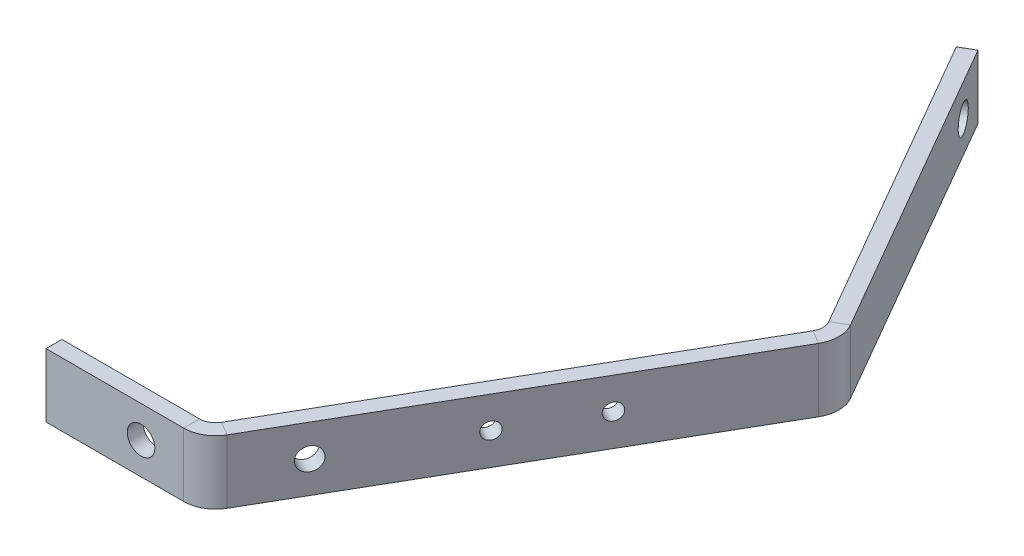
ISO-10303-21;
HEADER;
FILE_DESCRIPTION(('STEP AP214'),'2;1');
FILE_NAME('part.step','',(''),(''),'','','');
FILE_SCHEMA(('AUTOMOTIVE_DESIGN { 1 0 10303 214 1 1 1 1 }'));
ENDSEC;
DATA;
#1=APPLICATION_CONTEXT('core data for automotive mechanical design processes');
#2=APPLICATION_PROTOCOL_DEFINITION('international standard','automotive_design',2000,#1);
#3=PRODUCT_CONTEXT('',#1,'mechanical');
#4=PRODUCT('Part','Part','',(#3));
#5=PRODUCT_RELATED_PRODUCT_CATEGORY('part','',(#4));
#6=PRODUCT_DEFINITION_FORMATION('','',#4);
#7=PRODUCT_DEFINITION_CONTEXT('part definition',#1,'design');
#8=PRODUCT_DEFINITION('design','',#6,#7);
#9=PRODUCT_DEFINITION_SHAPE('','',#8);
#10=(LENGTH_UNIT() NAMED_UNIT(*) SI_UNIT(.MILLI.,.METRE.));
#11=(NAMED_UNIT(*) PLANE_ANGLE_UNIT() SI_UNIT($,.RADIAN.));
#12=(NAMED_UNIT(*) SI_UNIT($,.STERADIAN.) SOLID_ANGLE_UNIT());
#13=UNCERTAINTY_MEASURE_WITH_UNIT(LENGTH_MEASURE(1.E-05),#10,'distance_accuracy_value','');
#14=(GEOMETRIC_REPRESENTATION_CONTEXT(3) GLOBAL_UNCERTAINTY_ASSIGNED_CONTEXT((#13)) GLOBAL_UNIT_ASSIGNED_CONTEXT((#10,
#11,#12)) REPRESENTATION_CONTEXT('',''));
#15=CARTESIAN_POINT('',(0.,0.,0.));
#16=DIRECTION('',(0.,0.,1.));
#17=DIRECTION('',(1.,0.,0.));
#18=AXIS2_PLACEMENT_3D('',#15,#16,#17);
#19=CARTESIAN_POINT('',(-31.6157943029474,0.,-58.8228735853647));
#20=DIRECTION('',(-0.86602540378444,0.,-0.499999999999998));
#21=DIRECTION('',(-0.499999999999998,0.,0.86602540378444));
#22=AXIS2_PLACEMENT_3D('',#19,#20,#21);
#23=PLANE('',#22);
#24=CARTESIAN_POINT('',(-35.5167014642665,0.0399999999988743,-52.0663041863507));
#25=DIRECTION('',(-0.86602540378444,0.,-0.499999999999998));
#26=DIRECTION('',(-0.499999999999998,0.,0.86602540378444));
#27=AXIS2_PLACEMENT_3D('',#24,#25,#26);
#28=CIRCLE('',#27,1.65000000019319);
#29=CARTESIAN_POINT('',(-36.3417014643631,0.0399999999988743,-50.6373622699391));
#30=VERTEX_POINT('',#29);
#31=EDGE_CURVE('E615',#30,#30,#28,.T.);
#32=ORIENTED_EDGE('',*,*,#31,.T.);
#33=EDGE_LOOP('',(#32));
#34=FACE_BOUND('',#33,.T.);
#35=CARTESIAN_POINT('',(-57.7151263700535,0.,-13.617504401525));
#36=DIRECTION('',(-0.86602540378444,0.,-0.499999999999998));
#37=DIRECTION('',(-0.499999999999998,0.,0.86602540378444));
#38=AXIS2_PLACEMENT_3D('',#35,#36,#37);
#39=CIRCLE('',#38,2.25000000154887);
#40=CARTESIAN_POINT('',(-58.8401263708279,0.,-11.6689472416686));
#41=VERTEX_POINT('',#40);
#42=EDGE_CURVE('E616',#41,#41,#39,.T.);
#43=ORIENTED_EDGE('',*,*,#42,.T.);
#44=EDGE_LOOP('',(#43));
#45=FACE_BOUND('',#44,.T.);
#46=CARTESIAN_POINT('',(-44.4672014642664,0.0399999999988743,-36.5635834332055));
#47=DIRECTION('',(-0.86602540378444,0.,-0.499999999999998));
#48=DIRECTION('',(-0.499999999999998,0.,0.86602540378444));
#49=AXIS2_PLACEMENT_3D('',#46,#47,#48);
#50=CIRCLE('',#49,1.65);
#51=CARTESIAN_POINT('',(-45.2922014642664,0.0399999999988743,-35.1346415169612));
#52=VERTEX_POINT('',#51);
#53=EDGE_CURVE('E619',#52,#52,#50,.T.);
#54=ORIENTED_EDGE('',*,*,#53,.T.);
#55=EDGE_LOOP('',(#54));
#56=FACE_BOUND('',#55,.T.);
#57=DIRECTION('',(0.499999999999998,0.,-0.86602540378444));
#58=VECTOR('',#57,1.);
#59=CARTESIAN_POINT('',(-79.9907943029472,-6.35,24.9650842307798));
#60=LINE('',#59,#58);
#61=CARTESIAN_POINT('',(-63.7426657216148,-6.34999999999998,-3.17750000000001));
#62=VERTEX_POINT('',#61);
#63=CARTESIAN_POINT('',(-20.5207943029474,-6.35,-78.0399772953414));
#64=VERTEX_POINT('',#63);
#65=EDGE_CURVE('E62',#62,#64,#60,.T.);
#66=ORIENTED_EDGE('',*,*,#65,.T.);
#67=DIRECTION('',(0.,1.,0.));
#68=VECTOR('',#67,1.);
#69=CARTESIAN_POINT('',(-20.5207943029474,0.,-78.0399772953414));
#70=LINE('',#69,#68);
#71=CARTESIAN_POINT('',(-20.5207943029474,6.35,-78.0399772953414));
#72=VERTEX_POINT('',#71);
#73=EDGE_CURVE('E54',#64,#72,#70,.T.);
#74=ORIENTED_EDGE('',*,*,#73,.T.);
#75=DIRECTION('',(-0.499999999999998,0.,0.86602540378444));
#76=VECTOR('',#75,1.);
#77=CARTESIAN_POINT('',(-79.9907943029472,6.35,24.9650842307798));
#78=LINE('',#77,#76);
#79=CARTESIAN_POINT('',(-63.7426657216148,6.35,-3.17750000000001));
#80=VERTEX_POINT('',#79);
#81=EDGE_CURVE('E70',#72,#80,#78,.T.);
#82=ORIENTED_EDGE('',*,*,#81,.T.);
#83=DIRECTION('',(0.,1.,0.));
#84=VECTOR('',#83,1.);
#85=CARTESIAN_POINT('',(-63.7426657216148,0.,-3.17750000000001));
#86=LINE('',#85,#84);
#87=EDGE_CURVE('E232',#62,#80,#86,.T.);
#88=ORIENTED_EDGE('',*,*,#87,.F.);
#89=EDGE_LOOP('',(#66,#74,#82,#88));
#90=FACE_BOUND('',#89,.T.);
#91=ADVANCED_FACE('F45',(#34,#45,#56,#90),#23,.F.);
#92=CARTESIAN_POINT('',(-82.7404249599628,-6.35,23.3775842307799));
#93=DIRECTION('',(0.,-1.,0.));
#94=DIRECTION('',(-0.86602540378444,0.,-0.499999999999998));
#95=AXIS2_PLACEMENT_3D('',#92,#93,#94);
#96=PLANE('',#95);
#97=DIRECTION('',(-0.86602540378444,0.,-0.499999999999998));
#98=VECTOR('',#97,1.);
#99=CARTESIAN_POINT('',(-23.270424959963,-6.35,-79.6274772953414));
#100=LINE('',#99,#98);
#101=CARTESIAN_POINT('',(-23.270424959963,-6.34999999999999,-79.6274772953414));
#102=VERTEX_POINT('',#101);
#103=EDGE_CURVE('E12',#64,#102,#100,.T.);
#104=ORIENTED_EDGE('',*,*,#103,.F.);
#105=ORIENTED_EDGE('',*,*,#65,.F.);
#106=DIRECTION('',(-0.86602540378444,0.,-0.499999999999998));
#107=VECTOR('',#106,1.);
#108=CARTESIAN_POINT('',(-66.4922963786304,-6.35,-4.76500000000001));
#109=LINE('',#108,#107);
#110=CARTESIAN_POINT('',(-66.4922963786304,-6.34999999999999,-4.76500000000001));
#111=VERTEX_POINT('',#110);
#112=EDGE_CURVE('E228',#62,#111,#109,.T.);
#113=ORIENTED_EDGE('',*,*,#112,.T.);
#114=DIRECTION('',(0.499999999999998,0.,-0.86602540378444));
#115=VECTOR('',#114,1.);
#116=CARTESIAN_POINT('',(-82.7404249599628,-6.35,23.3775842307799));
#117=LINE('',#116,#115);
#118=EDGE_CURVE('E229',#111,#102,#117,.T.);
#119=ORIENTED_EDGE('',*,*,#118,.T.);
#120=EDGE_LOOP('',(#104,#105,#113,#119));
#121=FACE_BOUND('',#120,.T.);
#122=ADVANCED_FACE('F47',(#121),#96,.T.);
#123=CARTESIAN_POINT('',(-82.7404249599628,6.35,23.3775842307799));
#124=DIRECTION('',(0.,1.,0.));
#125=DIRECTION('',(0.86602540378444,0.,0.499999999999998));
#126=AXIS2_PLACEMENT_3D('',#123,#124,#125);
#127=PLANE('',#126);
#128=DIRECTION('',(0.86602540378444,0.,0.499999999999998));
#129=VECTOR('',#128,1.);
#130=CARTESIAN_POINT('',(-23.270424959963,6.35,-79.6274772953414));
#131=LINE('',#130,#129);
#132=CARTESIAN_POINT('',(-23.270424959963,6.35,-79.6274772953414));
#133=VERTEX_POINT('',#132);
#134=EDGE_CURVE('E240',#133,#72,#131,.T.);
#135=ORIENTED_EDGE('',*,*,#134,.F.);
#136=DIRECTION('',(-0.499999999999998,0.,0.86602540378444));
#137=VECTOR('',#136,1.);
#138=CARTESIAN_POINT('',(-82.7404249599628,6.35,23.3775842307799));
#139=LINE('',#138,#137);
#140=CARTESIAN_POINT('',(-66.4922963786304,6.35,-4.76500000000001));
#141=VERTEX_POINT('',#140);
#142=EDGE_CURVE('E245',#133,#141,#139,.T.);
#143=ORIENTED_EDGE('',*,*,#142,.T.);
#144=DIRECTION('',(0.86602540378444,0.,0.499999999999998));
#145=VECTOR('',#144,1.);
#146=CARTESIAN_POINT('',(-66.4922963786304,6.35,-4.76500000000001));
#147=LINE('',#146,#145);
#148=EDGE_CURVE('E235',#141,#80,#147,.T.);
#149=ORIENTED_EDGE('',*,*,#148,.T.);
#150=ORIENTED_EDGE('',*,*,#81,.F.);
#151=EDGE_LOOP('',(#135,#143,#149,#150));
#152=FACE_BOUND('',#151,.T.);
#153=ADVANCED_FACE('F292',(#152),#127,.T.);
#154=CARTESIAN_POINT('',(-34.365424959963,0.,-60.4103735853647));
#155=DIRECTION('',(-0.86602540378444,0.,-0.499999999999998));
#156=DIRECTION('',(-0.499999999999998,0.,0.86602540378444));
#157=AXIS2_PLACEMENT_3D('',#154,#155,#156);
#158=PLANE('',#157);
#159=CARTESIAN_POINT('',(-38.2663321212821,0.0399999999988743,-53.6538041863507));
#160=DIRECTION('',(-0.86602540378444,0.,-0.499999999999998));
#161=DIRECTION('',(-0.499999999999998,0.,0.86602540378444));
#162=AXIS2_PLACEMENT_3D('',#159,#160,#161);
#163=CIRCLE('',#162,1.65000000019319);
#164=CARTESIAN_POINT('',(-39.0913321213787,0.0399999999988743,-52.2248622699391));
#165=VERTEX_POINT('',#164);
#166=EDGE_CURVE('E613',#165,#165,#163,.T.);
#167=ORIENTED_EDGE('',*,*,#166,.F.);
#168=EDGE_LOOP('',(#167));
#169=FACE_BOUND('',#168,.T.);
#170=CARTESIAN_POINT('',(-60.4647570270691,0.,-15.205004401525));
#171=DIRECTION('',(-0.86602540378444,0.,-0.499999999999998));
#172=DIRECTION('',(-0.499999999999998,0.,0.86602540378444));
#173=AXIS2_PLACEMENT_3D('',#170,#171,#172);
#174=CIRCLE('',#173,2.25000000154887);
#175=CARTESIAN_POINT('',(-61.5897570278436,0.,-13.2564472416686));
#176=VERTEX_POINT('',#175);
#177=EDGE_CURVE('E627',#176,#176,#174,.T.);
#178=ORIENTED_EDGE('',*,*,#177,.F.);
#179=EDGE_LOOP('',(#178));
#180=FACE_BOUND('',#179,.T.);
#181=CARTESIAN_POINT('',(-47.216832121282,0.0399999999988743,-38.1510834332055));
#182=DIRECTION('',(-0.86602540378444,0.,-0.499999999999998));
#183=DIRECTION('',(-0.499999999999998,0.,0.86602540378444));
#184=AXIS2_PLACEMENT_3D('',#181,#182,#183);
#185=CIRCLE('',#184,1.65);
#186=CARTESIAN_POINT('',(-48.041832121282,0.0399999999988743,-36.7221415169612));
#187=VERTEX_POINT('',#186);
#188=EDGE_CURVE('E624',#187,#187,#185,.T.);
#189=ORIENTED_EDGE('',*,*,#188,.F.);
#190=EDGE_LOOP('',(#189));
#191=FACE_BOUND('',#190,.T.);
#192=DIRECTION('',(0.,1.,0.));
#193=VECTOR('',#192,1.);
#194=CARTESIAN_POINT('',(-23.270424959963,0.,-79.6274772953414));
#195=LINE('',#194,#193);
#196=EDGE_CURVE('E237',#102,#133,#195,.T.);
#197=ORIENTED_EDGE('',*,*,#196,.F.);
#198=ORIENTED_EDGE('',*,*,#118,.F.);
#199=DIRECTION('',(0.,1.,0.));
#200=VECTOR('',#199,1.);
#201=CARTESIAN_POINT('',(-66.4922963786304,0.,-4.76500000000001));
#202=LINE('',#201,#200);
#203=EDGE_CURVE('E225',#111,#141,#202,.T.);
#204=ORIENTED_EDGE('',*,*,#203,.T.);
#205=ORIENTED_EDGE('',*,*,#142,.F.);
#206=EDGE_LOOP('',(#197,#198,#204,#205));
#207=FACE_BOUND('',#206,.T.);
#208=ADVANCED_FACE('F284',(#169,#180,#191,#207),#158,.T.);
#209=CARTESIAN_POINT('',(-96.75,-6.35,-3.175));
#210=DIRECTION('',(-1.,0.,0.));
#211=DIRECTION('',(0.,0.,1.));
#212=AXIS2_PLACEMENT_3D('',#209,#210,#211);
#213=PLANE('',#212);
#214=DIRECTION('',(0.,-1.,0.));
#215=VECTOR('',#214,1.);
#216=CARTESIAN_POINT('',(-96.75,-6.35,0.));
#217=LINE('',#216,#215);
#218=CARTESIAN_POINT('',(-96.75,6.35,0.));
#219=VERTEX_POINT('',#218);
#220=CARTESIAN_POINT('',(-96.75,-6.35,0.));
#221=VERTEX_POINT('',#220);
#222=EDGE_CURVE('E200',#219,#221,#217,.T.);
#223=ORIENTED_EDGE('',*,*,#222,.F.);
#224=DIRECTION('',(0.,0.,1.));
#225=VECTOR('',#224,1.);
#226=CARTESIAN_POINT('',(-96.75,6.35,-3.175));
#227=LINE('',#226,#225);
#228=CARTESIAN_POINT('',(-96.75,6.35,-3.175));
#229=VERTEX_POINT('',#228);
#230=EDGE_CURVE('E195',#229,#219,#227,.T.);
#231=ORIENTED_EDGE('',*,*,#230,.F.);
#232=DIRECTION('',(0.,-1.,0.));
#233=VECTOR('',#232,1.);
#234=CARTESIAN_POINT('',(-96.75,-6.35,-3.175));
#235=LINE('',#234,#233);
#236=CARTESIAN_POINT('',(-96.75,-6.35,-3.175));
#237=VERTEX_POINT('',#236);
#238=EDGE_CURVE('E214',#229,#237,#235,.T.);
#239=ORIENTED_EDGE('',*,*,#238,.T.);
#240=DIRECTION('',(0.,0.,1.));
#241=VECTOR('',#240,1.);
#242=CARTESIAN_POINT('',(-96.75,-6.35,-3.175));
#243=LINE('',#242,#241);
#244=EDGE_CURVE('E212',#237,#221,#243,.T.);
#245=ORIENTED_EDGE('',*,*,#244,.T.);
#246=EDGE_LOOP('',(#223,#231,#239,#245));
#247=FACE_BOUND('',#246,.T.);
#248=ADVANCED_FACE('F324',(#247),#213,.T.);
#249=CARTESIAN_POINT('',(0.,0.,-3.175));
#250=DIRECTION('',(0.,0.,-1.));
#251=DIRECTION('',(-1.,0.,0.));
#252=AXIS2_PLACEMENT_3D('',#249,#250,#251);
#253=PLANE('',#252);
#254=CARTESIAN_POINT('',(-77.7722006397986,3.02535774210355E-12,-3.175));
#255=DIRECTION('',(0.,0.,-1.));
#256=DIRECTION('',(-1.,0.,0.));
#257=AXIS2_PLACEMENT_3D('',#254,#255,#256);
#258=CIRCLE('',#257,2.74999999950133);
#259=CARTESIAN_POINT('',(-80.5222006392999,3.02535774210355E-12,-3.175));
#260=VERTEX_POINT('',#259);
#261=EDGE_CURVE('E257',#260,#260,#258,.T.);
#262=ORIENTED_EDGE('',*,*,#261,.F.);
#263=EDGE_LOOP('',(#262));
#264=FACE_BOUND('',#263,.T.);
#265=DIRECTION('',(0.,1.,0.));
#266=VECTOR('',#265,1.);
#267=CARTESIAN_POINT('',(-69.2462571626649,0.,-3.175));
#268=LINE('',#267,#266);
#269=CARTESIAN_POINT('',(-69.2462571626649,-6.34999999999999,-3.175));
#270=VERTEX_POINT('',#269);
#271=CARTESIAN_POINT('',(-69.2462571626649,6.35,-3.175));
#272=VERTEX_POINT('',#271);
#273=EDGE_CURVE('E190',#270,#272,#268,.T.);
#274=ORIENTED_EDGE('',*,*,#273,.F.);
#275=DIRECTION('',(1.,0.,0.));
#276=VECTOR('',#275,1.);
#277=CARTESIAN_POINT('',(-96.75,-6.35,-3.175));
#278=LINE('',#277,#276);
#279=EDGE_CURVE('E210',#237,#270,#278,.T.);
#280=ORIENTED_EDGE('',*,*,#279,.F.);
#281=ORIENTED_EDGE('',*,*,#238,.F.);
#282=DIRECTION('',(-1.,0.,0.));
#283=VECTOR('',#282,1.);
#284=CARTESIAN_POINT('',(-96.75,6.35,-3.175));
#285=LINE('',#284,#283);
#286=EDGE_CURVE('E198',#272,#229,#285,.T.);
#287=ORIENTED_EDGE('',*,*,#286,.F.);
#288=EDGE_LOOP('',(#274,#280,#281,#287));
#289=FACE_BOUND('',#288,.T.);
#290=ADVANCED_FACE('F316',(#264,#289),#253,.T.);
#291=CARTESIAN_POINT('',(-96.75,-6.35,-3.175));
#292=DIRECTION('',(0.,-1.,0.));
#293=DIRECTION('',(0.,0.,-1.));
#294=AXIS2_PLACEMENT_3D('',#291,#292,#293);
#295=PLANE('',#294);
#296=DIRECTION('',(0.,0.,-1.));
#297=VECTOR('',#296,1.);
#298=CARTESIAN_POINT('',(-69.2462571626649,-6.35,-3.175));
#299=LINE('',#298,#297);
#300=CARTESIAN_POINT('',(-69.2462571626649,-6.35,0.));
#301=VERTEX_POINT('',#300);
#302=EDGE_CURVE('E217',#301,#270,#299,.T.);
#303=ORIENTED_EDGE('',*,*,#302,.F.);
#304=DIRECTION('',(1.,0.,0.));
#305=VECTOR('',#304,1.);
#306=CARTESIAN_POINT('',(-96.75,-6.35,0.));
#307=LINE('',#306,#305);
#308=EDGE_CURVE('E208',#221,#301,#307,.T.);
#309=ORIENTED_EDGE('',*,*,#308,.F.);
#310=ORIENTED_EDGE('',*,*,#244,.F.);
#311=ORIENTED_EDGE('',*,*,#279,.T.);
#312=EDGE_LOOP('',(#303,#309,#310,#311));
#313=FACE_BOUND('',#312,.T.);
#314=ADVANCED_FACE('F312',(#313),#295,.T.);
#315=CARTESIAN_POINT('',(0.,0.,0.));
#316=DIRECTION('',(0.,0.,-1.));
#317=DIRECTION('',(-1.,0.,0.));
#318=AXIS2_PLACEMENT_3D('',#315,#316,#317);
#319=PLANE('',#318);
#320=CARTESIAN_POINT('',(-77.7722006397986,3.02535774210355E-12,0.));
#321=DIRECTION('',(0.,0.,-1.));
#322=DIRECTION('',(-1.,0.,0.));
#323=AXIS2_PLACEMENT_3D('',#320,#321,#322);
#324=CIRCLE('',#323,2.74999999950133);
#325=CARTESIAN_POINT('',(-80.5222006392999,3.02535774210355E-12,0.));
#326=VERTEX_POINT('',#325);
#327=EDGE_CURVE('E49',#326,#326,#324,.T.);
#328=ORIENTED_EDGE('',*,*,#327,.T.);
#329=EDGE_LOOP('',(#328));
#330=FACE_BOUND('',#329,.T.);
#331=ORIENTED_EDGE('',*,*,#308,.T.);
#332=DIRECTION('',(0.,1.,0.));
#333=VECTOR('',#332,1.);
#334=CARTESIAN_POINT('',(-69.2462571626649,0.,0.));
#335=LINE('',#334,#333);
#336=CARTESIAN_POINT('',(-69.2462571626649,6.35,0.));
#337=VERTEX_POINT('',#336);
#338=EDGE_CURVE('E205',#301,#337,#335,.T.);
#339=ORIENTED_EDGE('',*,*,#338,.T.);
#340=DIRECTION('',(-1.,0.,0.));
#341=VECTOR('',#340,1.);
#342=CARTESIAN_POINT('',(-96.75,6.35,0.));
#343=LINE('',#342,#341);
#344=EDGE_CURVE('E203',#337,#219,#343,.T.);
#345=ORIENTED_EDGE('',*,*,#344,.T.);
#346=ORIENTED_EDGE('',*,*,#222,.T.);
#347=EDGE_LOOP('',(#331,#339,#345,#346));
#348=FACE_BOUND('',#347,.T.);
#349=ADVANCED_FACE('F322',(#330,#348),#319,.F.);
#350=CARTESIAN_POINT('',(-96.75,6.35,-3.175));
#351=DIRECTION('',(0.,1.,0.));
#352=DIRECTION('',(0.,0.,1.));
#353=AXIS2_PLACEMENT_3D('',#350,#351,#352);
#354=PLANE('',#353);
#355=DIRECTION('',(0.,0.,1.));
#356=VECTOR('',#355,1.);
#357=CARTESIAN_POINT('',(-69.2462571626649,6.35,-3.175));
#358=LINE('',#357,#356);
#359=EDGE_CURVE('E220',#272,#337,#358,.T.);
#360=ORIENTED_EDGE('',*,*,#359,.F.);
#361=ORIENTED_EDGE('',*,*,#286,.T.);
#362=ORIENTED_EDGE('',*,*,#230,.T.);
#363=ORIENTED_EDGE('',*,*,#344,.F.);
#364=EDGE_LOOP('',(#360,#361,#362,#363));
#365=FACE_BOUND('',#364,.T.);
#366=ADVANCED_FACE('F319',(#365),#354,.T.);
#367=CARTESIAN_POINT('',(-69.2462571626649,-6.34999999999999,-6.355));
#368=DIRECTION('',(0.,1.,0.));
#369=DIRECTION('',(0.,0.,1.));
#370=AXIS2_PLACEMENT_3D('',#367,#368,#369);
#371=PLANE('',#370);
#372=ORIENTED_EDGE('',*,*,#112,.F.);
#373=CARTESIAN_POINT('',(-69.2462571626649,-6.34999999999998,-6.355));
#374=DIRECTION('',(0.,-1.,0.));
#375=DIRECTION('',(0.,0.,-1.));
#376=AXIS2_PLACEMENT_3D('',#373,#374,#375);
#377=CIRCLE('',#376,6.355);
#378=EDGE_CURVE('E178',#62,#301,#377,.T.);
#379=ORIENTED_EDGE('',*,*,#378,.T.);
#380=ORIENTED_EDGE('',*,*,#302,.T.);
#381=CARTESIAN_POINT('',(-69.2462571626649,-6.34999999999999,-6.355));
#382=DIRECTION('',(0.,-1.,0.));
#383=DIRECTION('',(0.,0.,1.));
#384=AXIS2_PLACEMENT_3D('',#381,#382,#383);
#385=CIRCLE('',#384,3.18);
#386=EDGE_CURVE('E183',#111,#270,#385,.T.);
#387=ORIENTED_EDGE('',*,*,#386,.F.);
#388=EDGE_LOOP('',(#372,#379,#380,#387));
#389=FACE_BOUND('',#388,.T.);
#390=ADVANCED_FACE('F308',(#389),#371,.F.);
#391=CARTESIAN_POINT('',(-69.2462571626649,6.35,-6.355));
#392=DIRECTION('',(0.,-1.,0.));
#393=DIRECTION('',(0.,0.,-1.));
#394=AXIS2_PLACEMENT_3D('',#391,#392,#393);
#395=PLANE('',#394);
#396=CARTESIAN_POINT('',(-69.2462571626649,6.35,-6.355));
#397=DIRECTION('',(0.,-1.,0.));
#398=DIRECTION('',(0.,0.,-1.));
#399=AXIS2_PLACEMENT_3D('',#396,#397,#398);
#400=CIRCLE('',#399,6.355);
#401=EDGE_CURVE('E187',#337,#80,#400,.F.);
#402=ORIENTED_EDGE('',*,*,#401,.T.);
#403=ORIENTED_EDGE('',*,*,#148,.F.);
#404=CARTESIAN_POINT('',(-69.2462571626649,6.35,-6.355));
#405=DIRECTION('',(0.,1.,0.));
#406=DIRECTION('',(0.,0.,-1.));
#407=AXIS2_PLACEMENT_3D('',#404,#405,#406);
#408=CIRCLE('',#407,3.18);
#409=EDGE_CURVE('E186',#272,#141,#408,.T.);
#410=ORIENTED_EDGE('',*,*,#409,.F.);
#411=ORIENTED_EDGE('',*,*,#359,.T.);
#412=EDGE_LOOP('',(#402,#403,#410,#411));
#413=FACE_BOUND('',#412,.T.);
#414=ADVANCED_FACE('F300',(#413),#395,.F.);
#415=CARTESIAN_POINT('',(-69.2462571626649,14.0105611696542,-6.355));
#416=DIRECTION('',(0.,-1.,0.));
#417=DIRECTION('',(0.,0.,-1.));
#418=AXIS2_PLACEMENT_3D('',#415,#416,#417);
#419=CYLINDRICAL_SURFACE('',#418,3.18);
#420=ORIENTED_EDGE('',*,*,#273,.T.);
#421=ORIENTED_EDGE('',*,*,#409,.T.);
#422=ORIENTED_EDGE('',*,*,#203,.F.);
#423=ORIENTED_EDGE('',*,*,#386,.T.);
#424=EDGE_LOOP('',(#420,#421,#422,#423));
#425=FACE_BOUND('',#424,.T.);
#426=ADVANCED_FACE('F296',(#425),#419,.F.);
#427=CARTESIAN_POINT('',(-69.2462571626649,14.0105611696542,-6.355));
#428=DIRECTION('',(0.,-1.,0.));
#429=DIRECTION('',(0.,0.,-1.));
#430=AXIS2_PLACEMENT_3D('',#427,#428,#429);
#431=CYLINDRICAL_SURFACE('',#430,6.355);
#432=ORIENTED_EDGE('',*,*,#338,.F.);
#433=ORIENTED_EDGE('',*,*,#378,.F.);
#434=ORIENTED_EDGE('',*,*,#87,.T.);
#435=ORIENTED_EDGE('',*,*,#401,.F.);
#436=EDGE_LOOP('',(#432,#433,#434,#435));
#437=FACE_BOUND('',#436,.T.);
#438=ADVANCED_FACE('F305',(#437),#431,.T.);
#439=CARTESIAN_POINT('',(-26.0243857439975,-6.34999999999999,-81.2174772953414));
#440=DIRECTION('',(0.,1.,0.));
#441=DIRECTION('',(0.,0.,1.));
#442=AXIS2_PLACEMENT_3D('',#439,#440,#441);
#443=PLANE('',#442);
#444=DIRECTION('',(-0.866025403784436,0.,0.500000000000004));
#445=VECTOR('',#444,1.);
#446=CARTESIAN_POINT('',(-23.270424959963,-6.35,-82.8074772953414));
#447=LINE('',#446,#445);
#448=CARTESIAN_POINT('',(-20.5207943029475,-6.35,-84.3949772953415));
#449=VERTEX_POINT('',#448);
#450=CARTESIAN_POINT('',(-23.270424959963,-6.34999999999999,-82.8074772953414));
#451=VERTEX_POINT('',#450);
#452=EDGE_CURVE('E144',#449,#451,#447,.T.);
#453=ORIENTED_EDGE('',*,*,#452,.F.);
#454=CARTESIAN_POINT('',(-26.0243857439975,-6.34999999999998,-81.2174772953414));
#455=DIRECTION('',(0.,-1.,0.));
#456=DIRECTION('',(0.,0.,-1.));
#457=AXIS2_PLACEMENT_3D('',#454,#455,#456);
#458=CIRCLE('',#457,6.355);
#459=EDGE_CURVE('E155',#449,#64,#458,.T.);
#460=ORIENTED_EDGE('',*,*,#459,.T.);
#461=ORIENTED_EDGE('',*,*,#103,.T.);
#462=CARTESIAN_POINT('',(-26.0243857439975,-6.34999999999999,-81.2174772953414));
#463=DIRECTION('',(0.,-1.,0.));
#464=DIRECTION('',(0.,0.,1.));
#465=AXIS2_PLACEMENT_3D('',#462,#463,#464);
#466=CIRCLE('',#465,3.18);
#467=EDGE_CURVE('E171',#451,#102,#466,.T.);
#468=ORIENTED_EDGE('',*,*,#467,.F.);
#469=EDGE_LOOP('',(#453,#460,#461,#468));
#470=FACE_BOUND('',#469,.T.);
#471=ADVANCED_FACE('F286',(#470),#443,.F.);
#472=CARTESIAN_POINT('',(-26.0243857439975,6.35,-81.2174772953414));
#473=DIRECTION('',(0.,-1.,0.));
#474=DIRECTION('',(0.,0.,-1.));
#475=AXIS2_PLACEMENT_3D('',#472,#473,#474);
#476=PLANE('',#475);
#477=CARTESIAN_POINT('',(-26.0243857439975,6.35,-81.2174772953414));
#478=DIRECTION('',(0.,-1.,0.));
#479=DIRECTION('',(0.,0.,-1.));
#480=AXIS2_PLACEMENT_3D('',#477,#478,#479);
#481=CIRCLE('',#480,6.355);
#482=CARTESIAN_POINT('',(-20.5207943029475,6.35,-84.3949772953415));
#483=VERTEX_POINT('',#482);
#484=EDGE_CURVE('E175',#72,#483,#481,.F.);
#485=ORIENTED_EDGE('',*,*,#484,.T.);
#486=DIRECTION('',(0.866025403784436,0.,-0.500000000000004));
#487=VECTOR('',#486,1.);
#488=CARTESIAN_POINT('',(-23.270424959963,6.35,-82.8074772953414));
#489=LINE('',#488,#487);
#490=CARTESIAN_POINT('',(-23.2704249599631,6.35,-82.8074772953414));
#491=VERTEX_POINT('',#490);
#492=EDGE_CURVE('E267',#491,#483,#489,.T.);
#493=ORIENTED_EDGE('',*,*,#492,.F.);
#494=CARTESIAN_POINT('',(-26.0243857439975,6.35,-81.2174772953414));
#495=DIRECTION('',(0.,1.,0.));
#496=DIRECTION('',(0.,0.,-1.));
#497=AXIS2_PLACEMENT_3D('',#494,#495,#496);
#498=CIRCLE('',#497,3.18);
#499=EDGE_CURVE('E174',#133,#491,#498,.T.);
#500=ORIENTED_EDGE('',*,*,#499,.F.);
#501=ORIENTED_EDGE('',*,*,#134,.T.);
#502=EDGE_LOOP('',(#485,#493,#500,#501));
#503=FACE_BOUND('',#502,.T.);
#504=ADVANCED_FACE('F278',(#503),#476,.F.);
#505=CARTESIAN_POINT('',(-26.0243857439975,14.9583075639477,-81.2174772953414));
#506=DIRECTION('',(0.,-1.,0.));
#507=DIRECTION('',(0.,0.,-1.));
#508=AXIS2_PLACEMENT_3D('',#505,#506,#507);
#509=CYLINDRICAL_SURFACE('',#508,3.18);
#510=ORIENTED_EDGE('',*,*,#196,.T.);
#511=ORIENTED_EDGE('',*,*,#499,.T.);
#512=DIRECTION('',(0.,1.,0.));
#513=VECTOR('',#512,1.);
#514=CARTESIAN_POINT('',(-23.2704249599631,0.,-82.8074772953414));
#515=LINE('',#514,#513);
#516=EDGE_CURVE('E164',#451,#491,#515,.T.);
#517=ORIENTED_EDGE('',*,*,#516,.F.);
#518=ORIENTED_EDGE('',*,*,#467,.T.);
#519=EDGE_LOOP('',(#510,#511,#517,#518));
#520=FACE_BOUND('',#519,.T.);
#521=ADVANCED_FACE('F280',(#520),#509,.F.);
#522=CARTESIAN_POINT('',(-26.0243857439975,14.9583075639477,-81.2174772953414));
#523=DIRECTION('',(0.,-1.,0.));
#524=DIRECTION('',(0.,0.,-1.));
#525=AXIS2_PLACEMENT_3D('',#522,#523,#524);
#526=CYLINDRICAL_SURFACE('',#525,6.355);
#527=ORIENTED_EDGE('',*,*,#73,.F.);
#528=ORIENTED_EDGE('',*,*,#459,.F.);
#529=DIRECTION('',(0.,1.,0.));
#530=VECTOR('',#529,1.);
#531=CARTESIAN_POINT('',(-20.5207943029475,0.,-84.3949772953414));
#532=LINE('',#531,#530);
#533=EDGE_CURVE('E162',#449,#483,#532,.T.);
#534=ORIENTED_EDGE('',*,*,#533,.T.);
#535=ORIENTED_EDGE('',*,*,#484,.F.);
#536=EDGE_LOOP('',(#527,#528,#534,#535));
#537=FACE_BOUND('',#536,.T.);
#538=ADVANCED_FACE('F291',(#537),#526,.T.);
#539=CARTESIAN_POINT('',(-58.0541677972985,-6.35,-143.054687167016));
#540=DIRECTION('',(-0.500000000000004,0.,-0.866025403784436));
#541=DIRECTION('',(-0.866025403784436,0.,0.500000000000004));
#542=AXIS2_PLACEMENT_3D('',#539,#540,#541);
#543=PLANE('',#542);
#544=DIRECTION('',(0.,1.,0.));
#545=VECTOR('',#544,1.);
#546=CARTESIAN_POINT('',(-55.3045371402829,-6.35,-144.642187167016));
#547=LINE('',#546,#545);
#548=CARTESIAN_POINT('',(-55.3045371402829,-6.35,-144.642187167016));
#549=VERTEX_POINT('',#548);
#550=CARTESIAN_POINT('',(-55.3045371402829,6.35,-144.642187167016));
#551=VERTEX_POINT('',#550);
#552=EDGE_CURVE('E154',#549,#551,#547,.T.);
#553=ORIENTED_EDGE('',*,*,#552,.F.);
#554=DIRECTION('',(0.866025403784436,0.,-0.500000000000004));
#555=VECTOR('',#554,1.);
#556=CARTESIAN_POINT('',(-58.0541677972985,-6.35,-143.054687167016));
#557=LINE('',#556,#555);
#558=CARTESIAN_POINT('',(-58.0541677972985,-6.35,-143.054687167016));
#559=VERTEX_POINT('',#558);
#560=EDGE_CURVE('E141',#559,#549,#557,.T.);
#561=ORIENTED_EDGE('',*,*,#560,.F.);
#562=DIRECTION('',(0.,1.,0.));
#563=VECTOR('',#562,1.);
#564=CARTESIAN_POINT('',(-58.0541677972985,-6.35,-143.054687167016));
#565=LINE('',#564,#563);
#566=CARTESIAN_POINT('',(-58.0541677972985,6.35,-143.054687167016));
#567=VERTEX_POINT('',#566);
#568=EDGE_CURVE('E152',#559,#567,#565,.T.);
#569=ORIENTED_EDGE('',*,*,#568,.T.);
#570=DIRECTION('',(0.866025403784436,0.,-0.500000000000004));
#571=VECTOR('',#570,1.);
#572=CARTESIAN_POINT('',(-58.0541677972985,6.35,-143.054687167016));
#573=LINE('',#572,#571);
#574=EDGE_CURVE('E161',#567,#551,#573,.T.);
#575=ORIENTED_EDGE('',*,*,#574,.T.);
#576=EDGE_LOOP('',(#553,#561,#569,#575));
#577=FACE_BOUND('',#576,.T.);
#578=ADVANCED_FACE('F151',(#577),#543,.T.);
#579=CARTESIAN_POINT('',(-9.67916779729806,0.,-59.2667293508715));
#580=DIRECTION('',(-0.866025403784436,0.,0.500000000000004));
#581=DIRECTION('',(0.500000000000004,0.,0.866025403784436));
#582=AXIS2_PLACEMENT_3D('',#579,#580,#581);
#583=PLANE('',#582);
#584=CARTESIAN_POINT('',(-54.0282252934344,6.24500451351651E-13,-136.081550201972));
#585=DIRECTION('',(-0.866025403784436,0.,0.500000000000004));
#586=DIRECTION('',(0.500000000000004,0.,0.866025403784436));
#587=AXIS2_PLACEMENT_3D('',#584,#585,#586);
#588=CIRCLE('',#587,2.75);
#589=CARTESIAN_POINT('',(-52.6532252934344,6.24500451351651E-13,-133.699980341565));
#590=VERTEX_POINT('',#589);
#591=EDGE_CURVE('E249',#590,#590,#588,.T.);
#592=ORIENTED_EDGE('',*,*,#591,.F.);
#593=EDGE_LOOP('',(#592));
#594=FACE_BOUND('',#593,.T.);
#595=DIRECTION('',(-0.500000000000004,0.,-0.866025403784436));
#596=VECTOR('',#595,1.);
#597=CARTESIAN_POINT('',(38.6958322027023,-6.35,24.5212284652727));
#598=LINE('',#597,#596);
#599=EDGE_CURVE('E138',#451,#559,#598,.T.);
#600=ORIENTED_EDGE('',*,*,#599,.F.);
#601=ORIENTED_EDGE('',*,*,#516,.T.);
#602=DIRECTION('',(0.500000000000004,0.,0.866025403784436));
#603=VECTOR('',#602,1.);
#604=CARTESIAN_POINT('',(38.6958322027023,6.35,24.5212284652727));
#605=LINE('',#604,#603);
#606=EDGE_CURVE('E160',#567,#491,#605,.T.);
#607=ORIENTED_EDGE('',*,*,#606,.F.);
#608=ORIENTED_EDGE('',*,*,#568,.F.);
#609=EDGE_LOOP('',(#600,#601,#607,#608));
#610=FACE_BOUND('',#609,.T.);
#611=ADVANCED_FACE('F158',(#594,#610),#583,.T.);
#612=CARTESIAN_POINT('',(38.6958322027023,6.35,24.5212284652727));
#613=DIRECTION('',(0.,1.,0.));
#614=DIRECTION('',(0.866025403784436,0.,-0.500000000000004));
#615=AXIS2_PLACEMENT_3D('',#612,#613,#614);
#616=PLANE('',#615);
#617=ORIENTED_EDGE('',*,*,#606,.T.);
#618=ORIENTED_EDGE('',*,*,#492,.T.);
#619=DIRECTION('',(0.500000000000004,0.,0.866025403784436));
#620=VECTOR('',#619,1.);
#621=CARTESIAN_POINT('',(41.4454628597179,6.35,22.9337284652727));
#622=LINE('',#621,#620);
#623=EDGE_CURVE('E262',#551,#483,#622,.T.);
#624=ORIENTED_EDGE('',*,*,#623,.F.);
#625=ORIENTED_EDGE('',*,*,#574,.F.);
#626=EDGE_LOOP('',(#617,#618,#624,#625));
#627=FACE_BOUND('',#626,.T.);
#628=ADVANCED_FACE('F274',(#627),#616,.T.);
#629=CARTESIAN_POINT('',(-6.92953714028249,0.,-60.8542293508715));
#630=DIRECTION('',(-0.866025403784436,0.,0.500000000000004));
#631=DIRECTION('',(0.500000000000004,0.,0.866025403784436));
#632=AXIS2_PLACEMENT_3D('',#629,#630,#631);
#633=PLANE('',#632);
#634=CARTESIAN_POINT('',(-51.2785946364188,6.24500451351651E-13,-137.669050201972));
#635=DIRECTION('',(-0.866025403784436,0.,0.500000000000004));
#636=DIRECTION('',(0.500000000000004,0.,0.866025403784436));
#637=AXIS2_PLACEMENT_3D('',#634,#635,#636);
#638=CIRCLE('',#637,2.75);
#639=CARTESIAN_POINT('',(-49.9035946364188,6.24500451351651E-13,-135.287480341565));
#640=VERTEX_POINT('',#639);
#641=EDGE_CURVE('E167',#640,#640,#638,.T.);
#642=ORIENTED_EDGE('',*,*,#641,.T.);
#643=EDGE_LOOP('',(#642));
#644=FACE_BOUND('',#643,.T.);
#645=ORIENTED_EDGE('',*,*,#533,.F.);
#646=DIRECTION('',(-0.500000000000004,0.,-0.866025403784436));
#647=VECTOR('',#646,1.);
#648=CARTESIAN_POINT('',(41.4454628597179,-6.35,22.9337284652727));
#649=LINE('',#648,#647);
#650=EDGE_CURVE('E265',#449,#549,#649,.T.);
#651=ORIENTED_EDGE('',*,*,#650,.T.);
#652=ORIENTED_EDGE('',*,*,#552,.T.);
#653=ORIENTED_EDGE('',*,*,#623,.T.);
#654=EDGE_LOOP('',(#645,#651,#652,#653));
#655=FACE_BOUND('',#654,.T.);
#656=ADVANCED_FACE('F435',(#644,#655),#633,.F.);
#657=CARTESIAN_POINT('',(38.6958322027023,-6.35,24.5212284652727));
#658=DIRECTION('',(0.,-1.,0.));
#659=DIRECTION('',(-0.866025403784436,0.,0.500000000000004));
#660=AXIS2_PLACEMENT_3D('',#657,#658,#659);
#661=PLANE('',#660);
#662=ORIENTED_EDGE('',*,*,#650,.F.);
#663=ORIENTED_EDGE('',*,*,#452,.T.);
#664=ORIENTED_EDGE('',*,*,#599,.T.);
#665=ORIENTED_EDGE('',*,*,#560,.T.);
#666=EDGE_LOOP('',(#662,#663,#664,#665));
#667=FACE_BOUND('',#666,.T.);
#668=ADVANCED_FACE('F140',(#667),#661,.T.);
#669=CARTESIAN_POINT('',(-45.3679712555901,6.24500451351651E-13,-141.081550201972));
#670=DIRECTION('',(-0.866025403784436,0.,0.500000000000004));
#671=DIRECTION('',(0.500000000000004,0.,0.866025403784436));
#672=AXIS2_PLACEMENT_3D('',#669,#670,#671);
#673=CYLINDRICAL_SURFACE('',#672,2.75);
#674=ORIENTED_EDGE('',*,*,#591,.T.);
#675=EDGE_LOOP('',(#674));
#676=FACE_BOUND('',#675,.T.);
#677=ORIENTED_EDGE('',*,*,#641,.F.);
#678=EDGE_LOOP('',(#677));
#679=FACE_BOUND('',#678,.T.);
#680=ADVANCED_FACE('F447',(#676,#679),#673,.F.);
#681=CARTESIAN_POINT('',(-77.7722006397986,3.02535774210355E-12,6.825));
#682=DIRECTION('',(0.,0.,-1.));
#683=DIRECTION('',(-1.,0.,0.));
#684=AXIS2_PLACEMENT_3D('',#681,#682,#683);
#685=CYLINDRICAL_SURFACE('',#684,2.74999999950133);
#686=ORIENTED_EDGE('',*,*,#261,.T.);
#687=EDGE_LOOP('',(#686));
#688=FACE_BOUND('',#687,.T.);
#689=ORIENTED_EDGE('',*,*,#327,.F.);
#690=EDGE_LOOP('',(#689));
#691=FACE_BOUND('',#690,.T.);
#692=ADVANCED_FACE('F453',(#688,#691),#685,.F.);
#693=CARTESIAN_POINT('',(-38.5565780834377,0.0399999999988743,-33.1510834332055));
#694=DIRECTION('',(-0.86602540378444,0.,-0.499999999999998));
#695=DIRECTION('',(-0.499999999999998,0.,0.86602540378444));
#696=AXIS2_PLACEMENT_3D('',#693,#694,#695);
#697=CYLINDRICAL_SURFACE('',#696,1.65);
#698=ORIENTED_EDGE('',*,*,#188,.T.);
#699=EDGE_LOOP('',(#698));
#700=FACE_BOUND('',#699,.T.);
#701=ORIENTED_EDGE('',*,*,#53,.F.);
#702=EDGE_LOOP('',(#701));
#703=FACE_BOUND('',#702,.T.);
#704=ADVANCED_FACE('F459',(#700,#703),#697,.F.);
#705=CARTESIAN_POINT('',(-51.8045029892247,0.,-10.205004401525));
#706=DIRECTION('',(-0.86602540378444,0.,-0.499999999999998));
#707=DIRECTION('',(-0.499999999999998,0.,0.86602540378444));
#708=AXIS2_PLACEMENT_3D('',#705,#706,#707);
#709=CYLINDRICAL_SURFACE('',#708,2.25000000154887);
#710=ORIENTED_EDGE('',*,*,#177,.T.);
#711=EDGE_LOOP('',(#710));
#712=FACE_BOUND('',#711,.T.);
#713=ORIENTED_EDGE('',*,*,#42,.F.);
#714=EDGE_LOOP('',(#713));
#715=FACE_BOUND('',#714,.T.);
#716=ADVANCED_FACE('F467',(#712,#715),#709,.F.);
#717=CARTESIAN_POINT('',(-29.6060780834377,0.0399999999988743,-48.6538041863508));
#718=DIRECTION('',(-0.86602540378444,0.,-0.499999999999998));
#719=DIRECTION('',(-0.499999999999998,0.,0.86602540378444));
#720=AXIS2_PLACEMENT_3D('',#717,#718,#719);
#721=CYLINDRICAL_SURFACE('',#720,1.65000000019319);
#722=ORIENTED_EDGE('',*,*,#166,.T.);
#723=EDGE_LOOP('',(#722));
#724=FACE_BOUND('',#723,.T.);
#725=ORIENTED_EDGE('',*,*,#31,.F.);
#726=EDGE_LOOP('',(#725));
#727=FACE_BOUND('',#726,.T.);
#728=ADVANCED_FACE('F476',(#724,#727),#721,.F.);
#729=CLOSED_SHELL('',(#91,#122,#153,#208,#248,#290,#314,#349,#366,#390,#414,#426,#438,#471,#504,
#521,#538,#578,#611,#628,#656,#668,#680,#692,#704,#716,#728));
#730=MANIFOLD_SOLID_BREP('B2',#729);
#731=ADVANCED_BREP_SHAPE_REPRESENTATION('',(#18,#730),#14);
#732=SHAPE_DEFINITION_REPRESENTATION(#9,#731);
ENDSEC;
END-ISO-10303-21;
